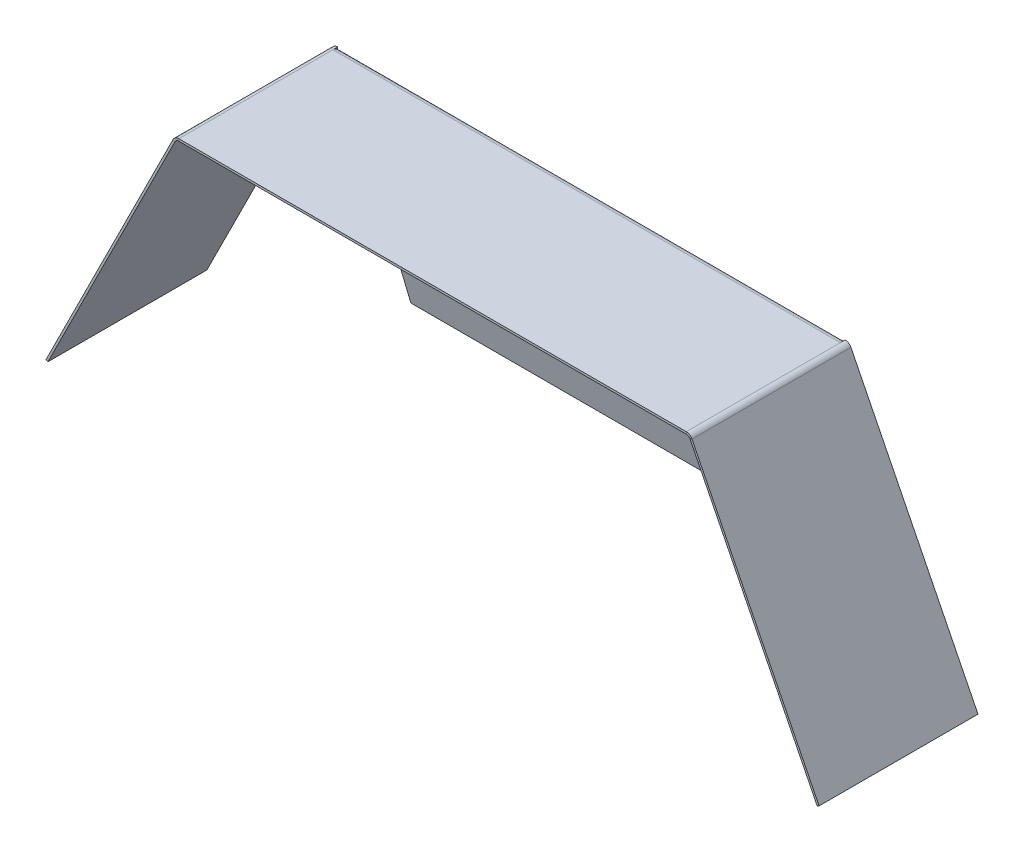
ISO-10303-21;
HEADER;
FILE_DESCRIPTION(('STEP AP214'),'2;1');
FILE_NAME('part.step','',(''),(''),'','','');
FILE_SCHEMA(('AUTOMOTIVE_DESIGN { 1 0 10303 214 1 1 1 1 }'));
ENDSEC;
DATA;
#1=APPLICATION_CONTEXT('core data for automotive mechanical design processes');
#2=APPLICATION_PROTOCOL_DEFINITION('international standard','automotive_design',2000,#1);
#3=PRODUCT_CONTEXT('',#1,'mechanical');
#4=PRODUCT('Part','Part','',(#3));
#5=PRODUCT_RELATED_PRODUCT_CATEGORY('part','',(#4));
#6=PRODUCT_DEFINITION_FORMATION('','',#4);
#7=PRODUCT_DEFINITION_CONTEXT('part definition',#1,'design');
#8=PRODUCT_DEFINITION('design','',#6,#7);
#9=PRODUCT_DEFINITION_SHAPE('','',#8);
#10=(LENGTH_UNIT() NAMED_UNIT(*) SI_UNIT(.MILLI.,.METRE.));
#11=(NAMED_UNIT(*) PLANE_ANGLE_UNIT() SI_UNIT($,.RADIAN.));
#12=(NAMED_UNIT(*) SI_UNIT($,.STERADIAN.) SOLID_ANGLE_UNIT());
#13=UNCERTAINTY_MEASURE_WITH_UNIT(LENGTH_MEASURE(1.E-05),#10,'distance_accuracy_value','');
#14=(GEOMETRIC_REPRESENTATION_CONTEXT(3) GLOBAL_UNCERTAINTY_ASSIGNED_CONTEXT((#13)) GLOBAL_UNIT_ASSIGNED_CONTEXT((#10,
#11,#12)) REPRESENTATION_CONTEXT('',''));
#15=CARTESIAN_POINT('',(0.,0.,0.));
#16=DIRECTION('',(0.,0.,1.));
#17=DIRECTION('',(1.,0.,0.));
#18=AXIS2_PLACEMENT_3D('',#15,#16,#17);
#19=CARTESIAN_POINT('',(120.82917960675,358.3416407865,37.));
#20=DIRECTION('',(0.,0.,1.));
#21=DIRECTION('',(1.,0.,0.));
#22=AXIS2_PLACEMENT_3D('',#19,#20,#21);
#23=PLANE('',#22);
#24=DIRECTION('',(-0.894427190999905,-0.44721359549998,0.));
#25=VECTOR('',#24,1.);
#26=CARTESIAN_POINT('',(120.82917960675,358.3416407865,37.));
#27=LINE('',#26,#25);
#28=CARTESIAN_POINT('',(120.82917960675,358.3416407865,37.));
#29=VERTEX_POINT('',#28);
#30=CARTESIAN_POINT('',(119.93475241575,357.894427191,37.));
#31=VERTEX_POINT('',#30);
#32=EDGE_CURVE('E12',#29,#31,#27,.T.);
#33=ORIENTED_EDGE('',*,*,#32,.F.);
#34=CARTESIAN_POINT('',(118.14589803375,357.,37.));
#35=DIRECTION('',(0.,0.,-1.));
#36=DIRECTION('',(-1.,0.,0.));
#37=AXIS2_PLACEMENT_3D('',#34,#35,#36);
#38=CIRCLE('',#37,3.);
#39=CARTESIAN_POINT('',(118.14589803375,360.,37.));
#40=VERTEX_POINT('',#39);
#41=EDGE_CURVE('E270',#40,#29,#38,.T.);
#42=ORIENTED_EDGE('',*,*,#41,.F.);
#43=DIRECTION('',(0.,1.,0.));
#44=VECTOR('',#43,1.);
#45=CARTESIAN_POINT('',(118.14589803375,359.,37.));
#46=LINE('',#45,#44);
#47=CARTESIAN_POINT('',(118.14589803375,359.,37.));
#48=VERTEX_POINT('',#47);
#49=EDGE_CURVE('E45',#48,#40,#46,.T.);
#50=ORIENTED_EDGE('',*,*,#49,.F.);
#51=CARTESIAN_POINT('',(118.14589803375,357.,37.));
#52=DIRECTION('',(0.,0.,1.));
#53=DIRECTION('',(1.,0.,0.));
#54=AXIS2_PLACEMENT_3D('',#51,#52,#53);
#55=CIRCLE('',#54,2.);
#56=EDGE_CURVE('E293',#48,#31,#55,.F.);
#57=ORIENTED_EDGE('',*,*,#56,.T.);
#58=EDGE_LOOP('',(#33,#42,#50,#57));
#59=FACE_BOUND('',#58,.T.);
#60=ADVANCED_FACE('F38',(#59),#23,.T.);
#61=CARTESIAN_POINT('',(118.14589803375,359.,37.));
#62=DIRECTION('',(0.,0.,1.));
#63=DIRECTION('',(1.,0.,0.));
#64=AXIS2_PLACEMENT_3D('',#61,#62,#63);
#65=PLANE('',#64);
#66=DIRECTION('',(0.447213595499958,-0.894427190999916,0.));
#67=VECTOR('',#66,1.);
#68=CARTESIAN_POINT('',(180.,240.,37.));
#69=LINE('',#68,#67);
#70=CARTESIAN_POINT('',(180.,240.,37.));
#71=VERTEX_POINT('',#70);
#72=EDGE_CURVE('E267',#29,#71,#69,.T.);
#73=ORIENTED_EDGE('',*,*,#72,.F.);
#74=ORIENTED_EDGE('',*,*,#32,.T.);
#75=DIRECTION('',(0.447213595499958,-0.894427190999916,0.));
#76=VECTOR('',#75,1.);
#77=CARTESIAN_POINT('',(179.105572809,239.5527864045,37.));
#78=LINE('',#77,#76);
#79=CARTESIAN_POINT('',(179.105572809,239.5527864045,37.));
#80=VERTEX_POINT('',#79);
#81=EDGE_CURVE('E262',#31,#80,#78,.T.);
#82=ORIENTED_EDGE('',*,*,#81,.T.);
#83=DIRECTION('',(-0.894427190999916,-0.447213595499958,0.));
#84=VECTOR('',#83,1.);
#85=CARTESIAN_POINT('',(180.,240.,37.));
#86=LINE('',#85,#84);
#87=EDGE_CURVE('E264',#71,#80,#86,.T.);
#88=ORIENTED_EDGE('',*,*,#87,.F.);
#89=EDGE_LOOP('',(#73,#74,#82,#88));
#90=FACE_BOUND('',#89,.T.);
#91=ADVANCED_FACE('F402',(#90),#65,.T.);
#92=CARTESIAN_POINT('',(118.14589803375,360.,-37.));
#93=DIRECTION('',(0.,0.,-1.));
#94=DIRECTION('',(-1.,0.,0.));
#95=AXIS2_PLACEMENT_3D('',#92,#93,#94);
#96=PLANE('',#95);
#97=DIRECTION('',(0.,-1.,0.));
#98=VECTOR('',#97,1.);
#99=CARTESIAN_POINT('',(118.14589803375,360.,-37.));
#100=LINE('',#99,#98);
#101=CARTESIAN_POINT('',(118.14589803375,360.,-37.));
#102=VERTEX_POINT('',#101);
#103=CARTESIAN_POINT('',(118.14589803375,359.,-37.));
#104=VERTEX_POINT('',#103);
#105=EDGE_CURVE('E341',#102,#104,#100,.T.);
#106=ORIENTED_EDGE('',*,*,#105,.F.);
#107=CARTESIAN_POINT('',(118.14589803375,357.,-37.));
#108=DIRECTION('',(0.,0.,-1.));
#109=DIRECTION('',(-1.,0.,0.));
#110=AXIS2_PLACEMENT_3D('',#107,#108,#109);
#111=CIRCLE('',#110,3.);
#112=CARTESIAN_POINT('',(120.82917960675,358.3416407865,-37.));
#113=VERTEX_POINT('',#112);
#114=EDGE_CURVE('E241',#102,#113,#111,.T.);
#115=ORIENTED_EDGE('',*,*,#114,.T.);
#116=DIRECTION('',(0.894427190999905,0.44721359549998,0.));
#117=VECTOR('',#116,1.);
#118=CARTESIAN_POINT('',(119.93475241575,357.894427191,-37.));
#119=LINE('',#118,#117);
#120=CARTESIAN_POINT('',(119.93475241575,357.894427191,-37.));
#121=VERTEX_POINT('',#120);
#122=EDGE_CURVE('E339',#121,#113,#119,.T.);
#123=ORIENTED_EDGE('',*,*,#122,.F.);
#124=CARTESIAN_POINT('',(118.14589803375,357.,-37.));
#125=DIRECTION('',(0.,0.,1.));
#126=DIRECTION('',(1.,0.,0.));
#127=AXIS2_PLACEMENT_3D('',#124,#125,#126);
#128=CIRCLE('',#127,2.);
#129=EDGE_CURVE('E259',#104,#121,#128,.F.);
#130=ORIENTED_EDGE('',*,*,#129,.F.);
#131=EDGE_LOOP('',(#106,#115,#123,#130));
#132=FACE_BOUND('',#131,.T.);
#133=ADVANCED_FACE('F409',(#132),#96,.T.);
#134=CARTESIAN_POINT('',(-118.14589803375,360.,37.));
#135=DIRECTION('',(0.,0.,1.));
#136=DIRECTION('',(1.,0.,0.));
#137=AXIS2_PLACEMENT_3D('',#134,#135,#136);
#138=PLANE('',#137);
#139=DIRECTION('',(0.,-1.,0.));
#140=VECTOR('',#139,1.);
#141=CARTESIAN_POINT('',(-118.14589803375,360.,37.));
#142=LINE('',#141,#140);
#143=CARTESIAN_POINT('',(-118.14589803375,360.,37.));
#144=VERTEX_POINT('',#143);
#145=CARTESIAN_POINT('',(-118.14589803375,359.,37.));
#146=VERTEX_POINT('',#145);
#147=EDGE_CURVE('E337',#144,#146,#142,.T.);
#148=ORIENTED_EDGE('',*,*,#147,.F.);
#149=CARTESIAN_POINT('',(-118.14589803375,357.,37.));
#150=DIRECTION('',(0.,0.,-1.));
#151=DIRECTION('',(-1.,0.,0.));
#152=AXIS2_PLACEMENT_3D('',#149,#150,#151);
#153=CIRCLE('',#152,3.);
#154=CARTESIAN_POINT('',(-120.82917960675,358.3416407865,37.));
#155=VERTEX_POINT('',#154);
#156=EDGE_CURVE('E276',#155,#144,#153,.T.);
#157=ORIENTED_EDGE('',*,*,#156,.F.);
#158=DIRECTION('',(-0.894427190999924,0.447213595499941,0.));
#159=VECTOR('',#158,1.);
#160=CARTESIAN_POINT('',(-119.93475241575,357.894427191,37.));
#161=LINE('',#160,#159);
#162=CARTESIAN_POINT('',(-119.93475241575,357.894427191,37.));
#163=VERTEX_POINT('',#162);
#164=EDGE_CURVE('E335',#163,#155,#161,.T.);
#165=ORIENTED_EDGE('',*,*,#164,.F.);
#166=CARTESIAN_POINT('',(-118.14589803375,357.,37.));
#167=DIRECTION('',(0.,0.,1.));
#168=DIRECTION('',(1.,0.,0.));
#169=AXIS2_PLACEMENT_3D('',#166,#167,#168);
#170=CIRCLE('',#169,2.);
#171=EDGE_CURVE('E288',#163,#146,#170,.F.);
#172=ORIENTED_EDGE('',*,*,#171,.T.);
#173=EDGE_LOOP('',(#148,#157,#165,#172));
#174=FACE_BOUND('',#173,.T.);
#175=ADVANCED_FACE('F364',(#174),#138,.T.);
#176=CARTESIAN_POINT('',(-119.93475241575,357.894427191,37.));
#177=DIRECTION('',(0.,0.,1.));
#178=DIRECTION('',(1.,0.,0.));
#179=AXIS2_PLACEMENT_3D('',#176,#177,#178);
#180=PLANE('',#179);
#181=DIRECTION('',(1.,0.,0.));
#182=VECTOR('',#181,1.);
#183=CARTESIAN_POINT('',(120.,360.,37.));
#184=LINE('',#183,#182);
#185=EDGE_CURVE('E273',#144,#40,#184,.T.);
#186=ORIENTED_EDGE('',*,*,#185,.F.);
#187=ORIENTED_EDGE('',*,*,#147,.T.);
#188=DIRECTION('',(1.,0.,0.));
#189=VECTOR('',#188,1.);
#190=CARTESIAN_POINT('',(120.,359.,37.));
#191=LINE('',#190,#189);
#192=EDGE_CURVE('E291',#146,#48,#191,.T.);
#193=ORIENTED_EDGE('',*,*,#192,.T.);
#194=ORIENTED_EDGE('',*,*,#49,.T.);
#195=EDGE_LOOP('',(#186,#187,#193,#194));
#196=FACE_BOUND('',#195,.T.);
#197=ADVANCED_FACE('F346',(#196),#180,.T.);
#198=CARTESIAN_POINT('',(-120.82917960675,358.3416407865,-37.));
#199=DIRECTION('',(0.,0.,-1.));
#200=DIRECTION('',(-1.,0.,0.));
#201=AXIS2_PLACEMENT_3D('',#198,#199,#200);
#202=PLANE('',#201);
#203=DIRECTION('',(0.894427190999924,-0.447213595499941,0.));
#204=VECTOR('',#203,1.);
#205=CARTESIAN_POINT('',(-120.82917960675,358.3416407865,-37.));
#206=LINE('',#205,#204);
#207=CARTESIAN_POINT('',(-120.82917960675,358.3416407865,-37.));
#208=VERTEX_POINT('',#207);
#209=CARTESIAN_POINT('',(-119.93475241575,357.894427191,-37.));
#210=VERTEX_POINT('',#209);
#211=EDGE_CURVE('E333',#208,#210,#206,.T.);
#212=ORIENTED_EDGE('',*,*,#211,.F.);
#213=CARTESIAN_POINT('',(-118.14589803375,357.,-37.));
#214=DIRECTION('',(0.,0.,-1.));
#215=DIRECTION('',(-1.,0.,0.));
#216=AXIS2_PLACEMENT_3D('',#213,#214,#215);
#217=CIRCLE('',#216,3.);
#218=CARTESIAN_POINT('',(-118.14589803375,360.,-37.));
#219=VERTEX_POINT('',#218);
#220=EDGE_CURVE('E244',#208,#219,#217,.T.);
#221=ORIENTED_EDGE('',*,*,#220,.T.);
#222=DIRECTION('',(0.,1.,0.));
#223=VECTOR('',#222,1.);
#224=CARTESIAN_POINT('',(-118.14589803375,359.,-37.));
#225=LINE('',#224,#223);
#226=CARTESIAN_POINT('',(-118.14589803375,359.,-37.));
#227=VERTEX_POINT('',#226);
#228=EDGE_CURVE('E331',#227,#219,#225,.T.);
#229=ORIENTED_EDGE('',*,*,#228,.F.);
#230=CARTESIAN_POINT('',(-118.14589803375,357.,-37.));
#231=DIRECTION('',(0.,0.,1.));
#232=DIRECTION('',(1.,0.,0.));
#233=AXIS2_PLACEMENT_3D('',#230,#231,#232);
#234=CIRCLE('',#233,2.);
#235=EDGE_CURVE('E256',#210,#227,#234,.F.);
#236=ORIENTED_EDGE('',*,*,#235,.F.);
#237=EDGE_LOOP('',(#212,#221,#229,#236));
#238=FACE_BOUND('',#237,.T.);
#239=ADVANCED_FACE('F422',(#238),#202,.T.);
#240=CARTESIAN_POINT('',(-118.14589803375,359.,-37.));
#241=DIRECTION('',(0.,0.,-1.));
#242=DIRECTION('',(-1.,0.,0.));
#243=AXIS2_PLACEMENT_3D('',#240,#241,#242);
#244=PLANE('',#243);
#245=DIRECTION('',(0.447213595499958,0.894427190999916,0.));
#246=VECTOR('',#245,1.);
#247=CARTESIAN_POINT('',(-180.,240.,-37.));
#248=LINE('',#247,#246);
#249=CARTESIAN_POINT('',(-180.,240.,-37.));
#250=VERTEX_POINT('',#249);
#251=EDGE_CURVE('E247',#250,#208,#248,.T.);
#252=ORIENTED_EDGE('',*,*,#251,.T.);
#253=ORIENTED_EDGE('',*,*,#211,.T.);
#254=DIRECTION('',(0.447213595499958,0.894427190999916,0.));
#255=VECTOR('',#254,1.);
#256=CARTESIAN_POINT('',(-179.105572809,239.5527864045,-37.));
#257=LINE('',#256,#255);
#258=CARTESIAN_POINT('',(-179.105572809,239.5527864045,-37.));
#259=VERTEX_POINT('',#258);
#260=EDGE_CURVE('E253',#259,#210,#257,.T.);
#261=ORIENTED_EDGE('',*,*,#260,.F.);
#262=DIRECTION('',(-0.894427190999916,0.447213595499958,0.));
#263=VECTOR('',#262,1.);
#264=CARTESIAN_POINT('',(-179.105572809,239.5527864045,-37.));
#265=LINE('',#264,#263);
#266=EDGE_CURVE('E250',#259,#250,#265,.T.);
#267=ORIENTED_EDGE('',*,*,#266,.T.);
#268=EDGE_LOOP('',(#252,#253,#261,#267));
#269=FACE_BOUND('',#268,.T.);
#270=ADVANCED_FACE('F462',(#269),#244,.T.);
#271=CARTESIAN_POINT('',(179.105572809,239.5527864045,37.));
#272=DIRECTION('',(0.894427190999916,0.447213595499958,0.));
#273=DIRECTION('',(-0.447213595499958,0.894427190999916,0.));
#274=AXIS2_PLACEMENT_3D('',#271,#272,#273);
#275=PLANE('',#274);
#276=DIRECTION('',(0.,0.,-1.));
#277=VECTOR('',#276,1.);
#278=CARTESIAN_POINT('',(119.93475241575,357.894427191,37.));
#279=LINE('',#278,#277);
#280=EDGE_CURVE('E295',#31,#121,#279,.T.);
#281=ORIENTED_EDGE('',*,*,#280,.T.);
#282=DIRECTION('',(0.447213595499958,-0.894427190999916,0.));
#283=VECTOR('',#282,1.);
#284=CARTESIAN_POINT('',(179.105572809,239.5527864045,-37.));
#285=LINE('',#284,#283);
#286=CARTESIAN_POINT('',(179.105572809,239.5527864045,-37.));
#287=VERTEX_POINT('',#286);
#288=EDGE_CURVE('E230',#121,#287,#285,.T.);
#289=ORIENTED_EDGE('',*,*,#288,.T.);
#290=DIRECTION('',(0.,0.,-1.));
#291=VECTOR('',#290,1.);
#292=CARTESIAN_POINT('',(179.105572809,239.5527864045,37.));
#293=LINE('',#292,#291);
#294=EDGE_CURVE('E329',#80,#287,#293,.T.);
#295=ORIENTED_EDGE('',*,*,#294,.F.);
#296=ORIENTED_EDGE('',*,*,#81,.F.);
#297=EDGE_LOOP('',(#281,#289,#295,#296));
#298=FACE_BOUND('',#297,.T.);
#299=ADVANCED_FACE('F400',(#298),#275,.F.);
#300=CARTESIAN_POINT('',(180.,240.,37.));
#301=DIRECTION('',(0.447213595499958,-0.894427190999916,0.));
#302=DIRECTION('',(0.894427190999916,0.447213595499958,0.));
#303=AXIS2_PLACEMENT_3D('',#300,#301,#302);
#304=PLANE('',#303);
#305=ORIENTED_EDGE('',*,*,#294,.T.);
#306=DIRECTION('',(-0.894427190999916,-0.447213595499958,0.));
#307=VECTOR('',#306,1.);
#308=CARTESIAN_POINT('',(180.,240.,-37.));
#309=LINE('',#308,#307);
#310=CARTESIAN_POINT('',(180.,240.,-37.));
#311=VERTEX_POINT('',#310);
#312=EDGE_CURVE('E235',#311,#287,#309,.T.);
#313=ORIENTED_EDGE('',*,*,#312,.F.);
#314=DIRECTION('',(0.,0.,-1.));
#315=VECTOR('',#314,1.);
#316=CARTESIAN_POINT('',(180.,240.,37.));
#317=LINE('',#316,#315);
#318=EDGE_CURVE('E327',#71,#311,#317,.T.);
#319=ORIENTED_EDGE('',*,*,#318,.F.);
#320=ORIENTED_EDGE('',*,*,#87,.T.);
#321=EDGE_LOOP('',(#305,#313,#319,#320));
#322=FACE_BOUND('',#321,.T.);
#323=ADVANCED_FACE('F468',(#322),#304,.T.);
#324=CARTESIAN_POINT('',(180.,240.,37.));
#325=DIRECTION('',(0.894427190999916,0.447213595499958,0.));
#326=DIRECTION('',(-0.447213595499958,0.894427190999916,0.));
#327=AXIS2_PLACEMENT_3D('',#324,#325,#326);
#328=PLANE('',#327);
#329=ORIENTED_EDGE('',*,*,#318,.T.);
#330=DIRECTION('',(0.447213595499958,-0.894427190999916,0.));
#331=VECTOR('',#330,1.);
#332=CARTESIAN_POINT('',(180.,240.,-37.));
#333=LINE('',#332,#331);
#334=EDGE_CURVE('E238',#113,#311,#333,.T.);
#335=ORIENTED_EDGE('',*,*,#334,.F.);
#336=DIRECTION('',(0.,0.,-1.));
#337=VECTOR('',#336,1.);
#338=CARTESIAN_POINT('',(120.82917960675,358.3416407865,37.));
#339=LINE('',#338,#337);
#340=EDGE_CURVE('E324',#29,#113,#339,.T.);
#341=ORIENTED_EDGE('',*,*,#340,.F.);
#342=ORIENTED_EDGE('',*,*,#72,.T.);
#343=EDGE_LOOP('',(#329,#335,#341,#342));
#344=FACE_BOUND('',#343,.T.);
#345=ADVANCED_FACE('F405',(#344),#328,.T.);
#346=CARTESIAN_POINT('',(118.14589803375,357.,37.));
#347=DIRECTION('',(0.,0.,-1.));
#348=DIRECTION('',(-1.,0.,0.));
#349=AXIS2_PLACEMENT_3D('',#346,#347,#348);
#350=CYLINDRICAL_SURFACE('',#349,3.);
#351=ORIENTED_EDGE('',*,*,#340,.T.);
#352=ORIENTED_EDGE('',*,*,#114,.F.);
#353=DIRECTION('',(0.,0.,-1.));
#354=VECTOR('',#353,1.);
#355=CARTESIAN_POINT('',(118.14589803375,360.,-34.75));
#356=LINE('',#355,#354);
#357=CARTESIAN_POINT('',(118.14589803375,360.,-34.75));
#358=VERTEX_POINT('',#357);
#359=EDGE_CURVE('E228',#358,#102,#356,.T.);
#360=ORIENTED_EDGE('',*,*,#359,.F.);
#361=DIRECTION('',(0.,0.,-1.));
#362=VECTOR('',#361,1.);
#363=CARTESIAN_POINT('',(118.14589803375,360.,37.));
#364=LINE('',#363,#362);
#365=EDGE_CURVE('E321',#40,#358,#364,.T.);
#366=ORIENTED_EDGE('',*,*,#365,.F.);
#367=ORIENTED_EDGE('',*,*,#41,.T.);
#368=EDGE_LOOP('',(#351,#352,#360,#366,#367));
#369=FACE_BOUND('',#368,.T.);
#370=ADVANCED_FACE('F351',(#369),#350,.T.);
#371=CARTESIAN_POINT('',(120.,360.,37.));
#372=DIRECTION('',(0.,1.,0.));
#373=DIRECTION('',(0.,0.,1.));
#374=AXIS2_PLACEMENT_3D('',#371,#372,#373);
#375=PLANE('',#374);
#376=DIRECTION('',(-1.,0.,0.));
#377=VECTOR('',#376,1.);
#378=CARTESIAN_POINT('',(118.14589803375,360.,-34.75));
#379=LINE('',#378,#377);
#380=CARTESIAN_POINT('',(-118.14589803375,360.,-34.75));
#381=VERTEX_POINT('',#380);
#382=EDGE_CURVE('E217',#358,#381,#379,.T.);
#383=ORIENTED_EDGE('',*,*,#382,.T.);
#384=DIRECTION('',(0.,0.,-1.));
#385=VECTOR('',#384,1.);
#386=CARTESIAN_POINT('',(-118.14589803375,360.,37.));
#387=LINE('',#386,#385);
#388=EDGE_CURVE('E318',#144,#381,#387,.T.);
#389=ORIENTED_EDGE('',*,*,#388,.F.);
#390=ORIENTED_EDGE('',*,*,#185,.T.);
#391=ORIENTED_EDGE('',*,*,#365,.T.);
#392=EDGE_LOOP('',(#383,#389,#390,#391));
#393=FACE_BOUND('',#392,.T.);
#394=ADVANCED_FACE('F356',(#393),#375,.T.);
#395=CARTESIAN_POINT('',(-118.14589803375,357.,37.));
#396=DIRECTION('',(0.,0.,-1.));
#397=DIRECTION('',(-1.,0.,0.));
#398=AXIS2_PLACEMENT_3D('',#395,#396,#397);
#399=CYLINDRICAL_SURFACE('',#398,3.);
#400=ORIENTED_EDGE('',*,*,#388,.T.);
#401=DIRECTION('',(0.,0.,-1.));
#402=VECTOR('',#401,1.);
#403=CARTESIAN_POINT('',(-118.14589803375,360.,-34.75));
#404=LINE('',#403,#402);
#405=EDGE_CURVE('E226',#381,#219,#404,.T.);
#406=ORIENTED_EDGE('',*,*,#405,.T.);
#407=ORIENTED_EDGE('',*,*,#220,.F.);
#408=DIRECTION('',(0.,0.,-1.));
#409=VECTOR('',#408,1.);
#410=CARTESIAN_POINT('',(-120.82917960675,358.3416407865,37.));
#411=LINE('',#410,#409);
#412=EDGE_CURVE('E315',#155,#208,#411,.T.);
#413=ORIENTED_EDGE('',*,*,#412,.F.);
#414=ORIENTED_EDGE('',*,*,#156,.T.);
#415=EDGE_LOOP('',(#400,#406,#407,#413,#414));
#416=FACE_BOUND('',#415,.T.);
#417=ADVANCED_FACE('F358',(#416),#399,.T.);
#418=CARTESIAN_POINT('',(-180.,240.,37.));
#419=DIRECTION('',(-0.894427190999916,0.447213595499958,0.));
#420=DIRECTION('',(-0.447213595499958,-0.894427190999916,0.));
#421=AXIS2_PLACEMENT_3D('',#418,#419,#420);
#422=PLANE('',#421);
#423=ORIENTED_EDGE('',*,*,#412,.T.);
#424=ORIENTED_EDGE('',*,*,#251,.F.);
#425=DIRECTION('',(0.,0.,-1.));
#426=VECTOR('',#425,1.);
#427=CARTESIAN_POINT('',(-180.,240.,37.));
#428=LINE('',#427,#426);
#429=CARTESIAN_POINT('',(-180.,240.,37.));
#430=VERTEX_POINT('',#429);
#431=EDGE_CURVE('E313',#430,#250,#428,.T.);
#432=ORIENTED_EDGE('',*,*,#431,.F.);
#433=DIRECTION('',(0.447213595499958,0.894427190999916,0.));
#434=VECTOR('',#433,1.);
#435=CARTESIAN_POINT('',(-180.,240.,37.));
#436=LINE('',#435,#434);
#437=EDGE_CURVE('E279',#430,#155,#436,.T.);
#438=ORIENTED_EDGE('',*,*,#437,.T.);
#439=EDGE_LOOP('',(#423,#424,#432,#438));
#440=FACE_BOUND('',#439,.T.);
#441=ADVANCED_FACE('F367',(#440),#422,.T.);
#442=CARTESIAN_POINT('',(-179.105572809,239.5527864045,37.));
#443=DIRECTION('',(-0.447213595499958,-0.894427190999916,0.));
#444=DIRECTION('',(0.894427190999916,-0.447213595499958,0.));
#445=AXIS2_PLACEMENT_3D('',#442,#443,#444);
#446=PLANE('',#445);
#447=ORIENTED_EDGE('',*,*,#431,.T.);
#448=ORIENTED_EDGE('',*,*,#266,.F.);
#449=DIRECTION('',(0.,0.,-1.));
#450=VECTOR('',#449,1.);
#451=CARTESIAN_POINT('',(-179.105572809,239.5527864045,37.));
#452=LINE('',#451,#450);
#453=CARTESIAN_POINT('',(-179.105572809,239.5527864045,37.));
#454=VERTEX_POINT('',#453);
#455=EDGE_CURVE('E311',#454,#259,#452,.T.);
#456=ORIENTED_EDGE('',*,*,#455,.F.);
#457=DIRECTION('',(-0.894427190999916,0.447213595499958,0.));
#458=VECTOR('',#457,1.);
#459=CARTESIAN_POINT('',(-179.105572809,239.5527864045,37.));
#460=LINE('',#459,#458);
#461=EDGE_CURVE('E282',#454,#430,#460,.T.);
#462=ORIENTED_EDGE('',*,*,#461,.T.);
#463=EDGE_LOOP('',(#447,#448,#456,#462));
#464=FACE_BOUND('',#463,.T.);
#465=ADVANCED_FACE('F373',(#464),#446,.T.);
#466=CARTESIAN_POINT('',(-179.105572809,239.5527864045,37.));
#467=DIRECTION('',(-0.894427190999916,0.447213595499958,0.));
#468=DIRECTION('',(-0.447213595499958,-0.894427190999916,0.));
#469=AXIS2_PLACEMENT_3D('',#466,#467,#468);
#470=PLANE('',#469);
#471=ORIENTED_EDGE('',*,*,#455,.T.);
#472=ORIENTED_EDGE('',*,*,#260,.T.);
#473=DIRECTION('',(0.,0.,-1.));
#474=VECTOR('',#473,1.);
#475=CARTESIAN_POINT('',(-119.93475241575,357.894427191,37.));
#476=LINE('',#475,#474);
#477=EDGE_CURVE('E307',#163,#210,#476,.T.);
#478=ORIENTED_EDGE('',*,*,#477,.F.);
#479=DIRECTION('',(0.447213595499958,0.894427190999916,0.));
#480=VECTOR('',#479,1.);
#481=CARTESIAN_POINT('',(-179.105572809,239.5527864045,37.));
#482=LINE('',#481,#480);
#483=EDGE_CURVE('E285',#454,#163,#482,.T.);
#484=ORIENTED_EDGE('',*,*,#483,.F.);
#485=EDGE_LOOP('',(#471,#472,#478,#484));
#486=FACE_BOUND('',#485,.T.);
#487=ADVANCED_FACE('F379',(#486),#470,.F.);
#488=CARTESIAN_POINT('',(-118.14589803375,357.,37.));
#489=DIRECTION('',(0.,0.,-1.));
#490=DIRECTION('',(-1.,0.,0.));
#491=AXIS2_PLACEMENT_3D('',#488,#489,#490);
#492=CYLINDRICAL_SURFACE('',#491,2.);
#493=ORIENTED_EDGE('',*,*,#477,.T.);
#494=ORIENTED_EDGE('',*,*,#235,.T.);
#495=DIRECTION('',(0.,0.,-1.));
#496=VECTOR('',#495,1.);
#497=CARTESIAN_POINT('',(-118.14589803375,359.,37.));
#498=LINE('',#497,#496);
#499=CARTESIAN_POINT('',(-118.14589803375,359.,-36.9860679774998));
#500=VERTEX_POINT('',#499);
#501=EDGE_CURVE('E302',#500,#227,#498,.T.);
#502=ORIENTED_EDGE('',*,*,#501,.F.);
#503=CARTESIAN_POINT('',(-118.14589803375,359.,-34.75));
#504=VERTEX_POINT('',#503);
#505=EDGE_CURVE('E308',#504,#500,#498,.T.);
#506=ORIENTED_EDGE('',*,*,#505,.F.);
#507=EDGE_CURVE('E304',#146,#504,#498,.T.);
#508=ORIENTED_EDGE('',*,*,#507,.F.);
#509=ORIENTED_EDGE('',*,*,#171,.F.);
#510=EDGE_LOOP('',(#493,#494,#502,#506,#508,#509));
#511=FACE_BOUND('',#510,.T.);
#512=ADVANCED_FACE('F384',(#511),#492,.F.);
#513=CARTESIAN_POINT('',(120.,359.,37.));
#514=DIRECTION('',(0.,1.,0.));
#515=DIRECTION('',(0.,0.,1.));
#516=AXIS2_PLACEMENT_3D('',#513,#514,#515);
#517=PLANE('',#516);
#518=ORIENTED_EDGE('',*,*,#507,.T.);
#519=DIRECTION('',(-1.,0.,0.));
#520=VECTOR('',#519,1.);
#521=CARTESIAN_POINT('',(118.14589803375,359.,-34.75));
#522=LINE('',#521,#520);
#523=CARTESIAN_POINT('',(118.14589803375,359.,-34.75));
#524=VERTEX_POINT('',#523);
#525=EDGE_CURVE('E197',#524,#504,#522,.T.);
#526=ORIENTED_EDGE('',*,*,#525,.F.);
#527=DIRECTION('',(0.,0.,-1.));
#528=VECTOR('',#527,1.);
#529=CARTESIAN_POINT('',(118.14589803375,359.,37.));
#530=LINE('',#529,#528);
#531=EDGE_CURVE('E299',#48,#524,#530,.T.);
#532=ORIENTED_EDGE('',*,*,#531,.F.);
#533=ORIENTED_EDGE('',*,*,#192,.F.);
#534=EDGE_LOOP('',(#518,#526,#532,#533));
#535=FACE_BOUND('',#534,.T.);
#536=ADVANCED_FACE('F389',(#535),#517,.F.);
#537=CARTESIAN_POINT('',(118.14589803375,357.,37.));
#538=DIRECTION('',(0.,0.,-1.));
#539=DIRECTION('',(-1.,0.,0.));
#540=AXIS2_PLACEMENT_3D('',#537,#538,#539);
#541=CYLINDRICAL_SURFACE('',#540,2.);
#542=ORIENTED_EDGE('',*,*,#531,.T.);
#543=CARTESIAN_POINT('',(118.14589803375,359.,-36.9860679774998));
#544=VERTEX_POINT('',#543);
#545=EDGE_CURVE('E303',#524,#544,#530,.T.);
#546=ORIENTED_EDGE('',*,*,#545,.T.);
#547=EDGE_CURVE('E298',#544,#104,#530,.T.);
#548=ORIENTED_EDGE('',*,*,#547,.T.);
#549=ORIENTED_EDGE('',*,*,#129,.T.);
#550=ORIENTED_EDGE('',*,*,#280,.F.);
#551=ORIENTED_EDGE('',*,*,#56,.F.);
#552=EDGE_LOOP('',(#542,#546,#548,#549,#550,#551));
#553=FACE_BOUND('',#552,.T.);
#554=ADVANCED_FACE('F394',(#553),#541,.F.);
#555=CARTESIAN_POINT('',(118.14589803375,357.,37.));
#556=DIRECTION('',(0.,0.,-1.));
#557=DIRECTION('',(-1.,0.,0.));
#558=AXIS2_PLACEMENT_3D('',#555,#556,#557);
#559=PLANE('',#558);
#560=ORIENTED_EDGE('',*,*,#483,.T.);
#561=ORIENTED_EDGE('',*,*,#164,.T.);
#562=ORIENTED_EDGE('',*,*,#437,.F.);
#563=ORIENTED_EDGE('',*,*,#461,.F.);
#564=EDGE_LOOP('',(#560,#561,#562,#563));
#565=FACE_BOUND('',#564,.T.);
#566=ADVANCED_FACE('F371',(#565),#559,.F.);
#567=CARTESIAN_POINT('',(118.14589803375,357.,-37.));
#568=DIRECTION('',(0.,0.,-1.));
#569=DIRECTION('',(-1.,0.,0.));
#570=AXIS2_PLACEMENT_3D('',#567,#568,#569);
#571=PLANE('',#570);
#572=ORIENTED_EDGE('',*,*,#288,.F.);
#573=ORIENTED_EDGE('',*,*,#122,.T.);
#574=ORIENTED_EDGE('',*,*,#334,.T.);
#575=ORIENTED_EDGE('',*,*,#312,.T.);
#576=EDGE_LOOP('',(#572,#573,#574,#575));
#577=FACE_BOUND('',#576,.T.);
#578=ADVANCED_FACE('F493',(#577),#571,.T.);
#579=CARTESIAN_POINT('',(-118.14589803375,360.,-34.75));
#580=DIRECTION('',(-1.,0.,0.));
#581=DIRECTION('',(0.,0.,1.));
#582=AXIS2_PLACEMENT_3D('',#579,#580,#581);
#583=PLANE('',#582);
#584=ORIENTED_EDGE('',*,*,#405,.F.);
#585=CARTESIAN_POINT('',(-118.14589803375,357.,-34.75));
#586=DIRECTION('',(1.,0.,0.));
#587=DIRECTION('',(0.,0.,-1.));
#588=AXIS2_PLACEMENT_3D('',#585,#586,#587);
#589=CIRCLE('',#588,3.);
#590=EDGE_CURVE('E210',#381,#500,#589,.F.);
#591=ORIENTED_EDGE('',*,*,#590,.T.);
#592=ORIENTED_EDGE('',*,*,#501,.T.);
#593=ORIENTED_EDGE('',*,*,#228,.T.);
#594=EDGE_LOOP('',(#584,#591,#592,#593));
#595=FACE_BOUND('',#594,.T.);
#596=ADVANCED_FACE('F419',(#595),#583,.F.);
#597=CARTESIAN_POINT('',(118.14589803375,360.,-34.75));
#598=DIRECTION('',(-1.,0.,0.));
#599=DIRECTION('',(0.,0.,1.));
#600=AXIS2_PLACEMENT_3D('',#597,#598,#599);
#601=PLANE('',#600);
#602=CARTESIAN_POINT('',(118.14589803375,357.,-34.75));
#603=DIRECTION('',(1.,0.,0.));
#604=DIRECTION('',(0.,0.,-1.));
#605=AXIS2_PLACEMENT_3D('',#602,#603,#604);
#606=CIRCLE('',#605,3.);
#607=EDGE_CURVE('E205',#358,#544,#606,.F.);
#608=ORIENTED_EDGE('',*,*,#607,.F.);
#609=ORIENTED_EDGE('',*,*,#359,.T.);
#610=ORIENTED_EDGE('',*,*,#105,.T.);
#611=ORIENTED_EDGE('',*,*,#547,.F.);
#612=EDGE_LOOP('',(#608,#609,#610,#611));
#613=FACE_BOUND('',#612,.T.);
#614=ADVANCED_FACE('F413',(#613),#601,.T.);
#615=CARTESIAN_POINT('',(118.14589803375,357.,-34.75));
#616=DIRECTION('',(-1.,0.,0.));
#617=DIRECTION('',(0.,0.,1.));
#618=AXIS2_PLACEMENT_3D('',#615,#616,#617);
#619=PLANE('',#618);
#620=ORIENTED_EDGE('',*,*,#545,.F.);
#621=CARTESIAN_POINT('',(118.14589803375,357.,-34.75));
#622=DIRECTION('',(-1.,0.,0.));
#623=DIRECTION('',(0.,0.,1.));
#624=AXIS2_PLACEMENT_3D('',#621,#622,#623);
#625=CIRCLE('',#624,2.);
#626=CARTESIAN_POINT('',(118.14589803375,357.56,-36.67));
#627=VERTEX_POINT('',#626);
#628=EDGE_CURVE('E200',#524,#627,#625,.T.);
#629=ORIENTED_EDGE('',*,*,#628,.T.);
#630=DIRECTION('',(0.,-0.280000000000002,0.96));
#631=VECTOR('',#630,1.);
#632=CARTESIAN_POINT('',(118.14589803375,357.84,-37.63));
#633=LINE('',#632,#631);
#634=CARTESIAN_POINT('',(118.14589803375,357.84,-37.63));
#635=VERTEX_POINT('',#634);
#636=EDGE_CURVE('E225',#635,#627,#633,.T.);
#637=ORIENTED_EDGE('',*,*,#636,.F.);
#638=EDGE_CURVE('E209',#544,#635,#606,.F.);
#639=ORIENTED_EDGE('',*,*,#638,.F.);
#640=EDGE_LOOP('',(#620,#629,#637,#639));
#641=FACE_BOUND('',#640,.T.);
#642=ADVANCED_FACE('F430',(#641),#619,.F.);
#643=CARTESIAN_POINT('',(-118.14589803375,357.,-34.75));
#644=DIRECTION('',(-1.,0.,0.));
#645=DIRECTION('',(0.,0.,1.));
#646=AXIS2_PLACEMENT_3D('',#643,#644,#645);
#647=PLANE('',#646);
#648=ORIENTED_EDGE('',*,*,#505,.T.);
#649=CARTESIAN_POINT('',(-118.14589803375,357.84,-37.63));
#650=VERTEX_POINT('',#649);
#651=EDGE_CURVE('E214',#500,#650,#589,.F.);
#652=ORIENTED_EDGE('',*,*,#651,.T.);
#653=DIRECTION('',(0.,-0.28,0.96));
#654=VECTOR('',#653,1.);
#655=CARTESIAN_POINT('',(-118.14589803375,357.84,-37.63));
#656=LINE('',#655,#654);
#657=CARTESIAN_POINT('',(-118.14589803375,357.56,-36.67));
#658=VERTEX_POINT('',#657);
#659=EDGE_CURVE('E177',#650,#658,#656,.T.);
#660=ORIENTED_EDGE('',*,*,#659,.T.);
#661=CARTESIAN_POINT('',(-118.14589803375,357.,-34.75));
#662=DIRECTION('',(-1.,0.,0.));
#663=DIRECTION('',(0.,0.,1.));
#664=AXIS2_PLACEMENT_3D('',#661,#662,#663);
#665=CIRCLE('',#664,2.);
#666=EDGE_CURVE('E194',#504,#658,#665,.T.);
#667=ORIENTED_EDGE('',*,*,#666,.F.);
#668=EDGE_LOOP('',(#648,#652,#660,#667));
#669=FACE_BOUND('',#668,.T.);
#670=ADVANCED_FACE('F425',(#669),#647,.T.);
#671=CARTESIAN_POINT('',(-118.14589803375,360.,-37.));
#672=DIRECTION('',(1.,0.,0.));
#673=DIRECTION('',(0.,-0.96,-0.28));
#674=AXIS2_PLACEMENT_3D('',#671,#672,#673);
#675=PLANE('',#674);
#676=ORIENTED_EDGE('',*,*,#659,.F.);
#677=DIRECTION('',(0.,-0.96,-0.28));
#678=VECTOR('',#677,1.);
#679=CARTESIAN_POINT('',(-118.14589803375,360.,-37.));
#680=LINE('',#679,#678);
#681=CARTESIAN_POINT('',(-118.14589803375,240.,-72.));
#682=VERTEX_POINT('',#681);
#683=EDGE_CURVE('E172',#650,#682,#680,.T.);
#684=ORIENTED_EDGE('',*,*,#683,.T.);
#685=DIRECTION('',(0.,-0.28,0.96));
#686=VECTOR('',#685,1.);
#687=CARTESIAN_POINT('',(-118.14589803375,240.,-72.));
#688=LINE('',#687,#686);
#689=CARTESIAN_POINT('',(-118.14589803375,239.72,-71.04));
#690=VERTEX_POINT('',#689);
#691=EDGE_CURVE('E165',#682,#690,#688,.T.);
#692=ORIENTED_EDGE('',*,*,#691,.T.);
#693=DIRECTION('',(0.,0.96,0.28));
#694=VECTOR('',#693,1.);
#695=CARTESIAN_POINT('',(-118.14589803375,359.72,-36.04));
#696=LINE('',#695,#694);
#697=EDGE_CURVE('E169',#658,#690,#696,.F.);
#698=ORIENTED_EDGE('',*,*,#697,.F.);
#699=EDGE_LOOP('',(#676,#684,#692,#698));
#700=FACE_BOUND('',#699,.T.);
#701=ADVANCED_FACE('F168',(#700),#675,.F.);
#702=CARTESIAN_POINT('',(118.14589803375,240.,-72.));
#703=DIRECTION('',(0.,-0.96,-0.28));
#704=DIRECTION('',(-1.,0.,0.));
#705=AXIS2_PLACEMENT_3D('',#702,#703,#704);
#706=PLANE('',#705);
#707=ORIENTED_EDGE('',*,*,#691,.F.);
#708=DIRECTION('',(-1.,0.,0.));
#709=VECTOR('',#708,1.);
#710=CARTESIAN_POINT('',(118.14589803375,240.,-72.));
#711=LINE('',#710,#709);
#712=CARTESIAN_POINT('',(118.14589803375,240.,-72.));
#713=VERTEX_POINT('',#712);
#714=EDGE_CURVE('E203',#713,#682,#711,.T.);
#715=ORIENTED_EDGE('',*,*,#714,.F.);
#716=DIRECTION('',(0.,-0.28,0.96));
#717=VECTOR('',#716,1.);
#718=CARTESIAN_POINT('',(118.14589803375,240.,-72.));
#719=LINE('',#718,#717);
#720=CARTESIAN_POINT('',(118.14589803375,239.72,-71.04));
#721=VERTEX_POINT('',#720);
#722=EDGE_CURVE('E178',#713,#721,#719,.T.);
#723=ORIENTED_EDGE('',*,*,#722,.T.);
#724=DIRECTION('',(1.,0.,0.));
#725=VECTOR('',#724,1.);
#726=CARTESIAN_POINT('',(118.14589803375,239.72,-71.04));
#727=LINE('',#726,#725);
#728=EDGE_CURVE('E184',#721,#690,#727,.F.);
#729=ORIENTED_EDGE('',*,*,#728,.T.);
#730=EDGE_LOOP('',(#707,#715,#723,#729));
#731=FACE_BOUND('',#730,.T.);
#732=ADVANCED_FACE('F188',(#731),#706,.T.);
#733=CARTESIAN_POINT('',(118.14589803375,360.,-37.));
#734=DIRECTION('',(1.,0.,0.));
#735=DIRECTION('',(0.,-0.96,-0.28));
#736=AXIS2_PLACEMENT_3D('',#733,#734,#735);
#737=PLANE('',#736);
#738=DIRECTION('',(0.,-0.96,-0.28));
#739=VECTOR('',#738,1.);
#740=CARTESIAN_POINT('',(118.14589803375,360.,-37.));
#741=LINE('',#740,#739);
#742=EDGE_CURVE('E208',#635,#713,#741,.T.);
#743=ORIENTED_EDGE('',*,*,#742,.F.);
#744=ORIENTED_EDGE('',*,*,#636,.T.);
#745=DIRECTION('',(0.,0.96,0.28));
#746=VECTOR('',#745,1.);
#747=CARTESIAN_POINT('',(118.14589803375,359.72,-36.04));
#748=LINE('',#747,#746);
#749=EDGE_CURVE('E199',#627,#721,#748,.F.);
#750=ORIENTED_EDGE('',*,*,#749,.T.);
#751=ORIENTED_EDGE('',*,*,#722,.F.);
#752=EDGE_LOOP('',(#743,#744,#750,#751));
#753=FACE_BOUND('',#752,.T.);
#754=ADVANCED_FACE('F436',(#753),#737,.T.);
#755=CARTESIAN_POINT('',(118.14589803375,359.72,-36.04));
#756=DIRECTION('',(0.,0.28,-0.96));
#757=DIRECTION('',(0.,0.96,0.28));
#758=AXIS2_PLACEMENT_3D('',#755,#756,#757);
#759=PLANE('',#758);
#760=ORIENTED_EDGE('',*,*,#728,.F.);
#761=ORIENTED_EDGE('',*,*,#749,.F.);
#762=DIRECTION('',(1.,0.,0.));
#763=VECTOR('',#762,1.);
#764=CARTESIAN_POINT('',(118.14589803375,357.56,-36.67));
#765=LINE('',#764,#763);
#766=EDGE_CURVE('E186',#627,#658,#765,.F.);
#767=ORIENTED_EDGE('',*,*,#766,.T.);
#768=ORIENTED_EDGE('',*,*,#697,.T.);
#769=EDGE_LOOP('',(#760,#761,#767,#768));
#770=FACE_BOUND('',#769,.T.);
#771=ADVANCED_FACE('F182',(#770),#759,.F.);
#772=CARTESIAN_POINT('',(118.14589803375,357.,-34.75));
#773=DIRECTION('',(-1.,0.,0.));
#774=DIRECTION('',(0.,0.,1.));
#775=AXIS2_PLACEMENT_3D('',#772,#773,#774);
#776=CYLINDRICAL_SURFACE('',#775,2.);
#777=ORIENTED_EDGE('',*,*,#766,.F.);
#778=ORIENTED_EDGE('',*,*,#628,.F.);
#779=ORIENTED_EDGE('',*,*,#525,.T.);
#780=ORIENTED_EDGE('',*,*,#666,.T.);
#781=EDGE_LOOP('',(#777,#778,#779,#780));
#782=FACE_BOUND('',#781,.T.);
#783=ADVANCED_FACE('F427',(#782),#776,.F.);
#784=CARTESIAN_POINT('',(118.14589803375,360.,-37.));
#785=DIRECTION('',(0.,0.28,-0.96));
#786=DIRECTION('',(0.,0.96,0.28));
#787=AXIS2_PLACEMENT_3D('',#784,#785,#786);
#788=PLANE('',#787);
#789=ORIENTED_EDGE('',*,*,#714,.T.);
#790=ORIENTED_EDGE('',*,*,#683,.F.);
#791=DIRECTION('',(-1.,0.,0.));
#792=VECTOR('',#791,1.);
#793=CARTESIAN_POINT('',(118.14589803375,357.84,-37.63));
#794=LINE('',#793,#792);
#795=EDGE_CURVE('E213',#635,#650,#794,.T.);
#796=ORIENTED_EDGE('',*,*,#795,.F.);
#797=ORIENTED_EDGE('',*,*,#742,.T.);
#798=EDGE_LOOP('',(#789,#790,#796,#797));
#799=FACE_BOUND('',#798,.T.);
#800=ADVANCED_FACE('F435',(#799),#788,.T.);
#801=CARTESIAN_POINT('',(118.14589803375,357.,-34.75));
#802=DIRECTION('',(-1.,0.,0.));
#803=DIRECTION('',(0.,0.,1.));
#804=AXIS2_PLACEMENT_3D('',#801,#802,#803);
#805=CYLINDRICAL_SURFACE('',#804,3.);
#806=ORIENTED_EDGE('',*,*,#795,.T.);
#807=ORIENTED_EDGE('',*,*,#651,.F.);
#808=ORIENTED_EDGE('',*,*,#590,.F.);
#809=ORIENTED_EDGE('',*,*,#382,.F.);
#810=ORIENTED_EDGE('',*,*,#607,.T.);
#811=ORIENTED_EDGE('',*,*,#638,.T.);
#812=EDGE_LOOP('',(#806,#807,#808,#809,#810,#811));
#813=FACE_BOUND('',#812,.T.);
#814=ADVANCED_FACE('F415',(#813),#805,.T.);
#815=CLOSED_SHELL('',(#60,#91,#133,#175,#197,#239,#270,#299,#323,#345,#370,#394,#417,#441,#465,
#487,#512,#536,#554,#566,#578,#596,#614,#642,#670,#701,#732,#754,#771,#783,#800,#814));
#816=MANIFOLD_SOLID_BREP('B2',#815);
#817=ADVANCED_BREP_SHAPE_REPRESENTATION('',(#18,#816),#14);
#818=SHAPE_DEFINITION_REPRESENTATION(#9,#817);
ENDSEC;
END-ISO-10303-21;
